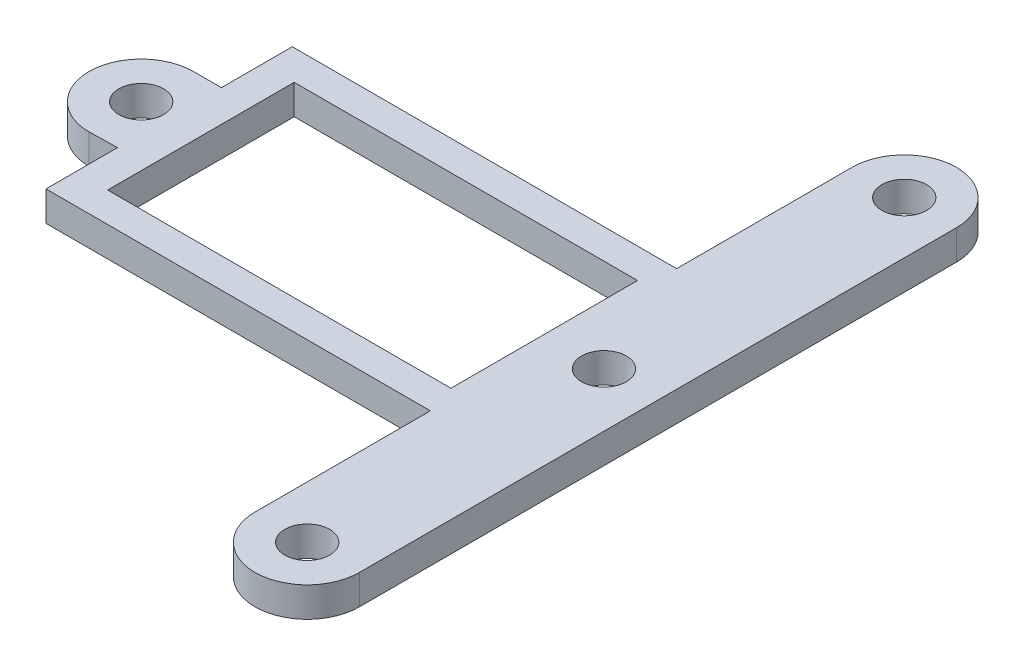
ISO-10303-21;
HEADER;
FILE_DESCRIPTION(('STEP AP214'),'2;1');
FILE_NAME('part.step','',(''),(''),'','','');
FILE_SCHEMA(('AUTOMOTIVE_DESIGN { 1 0 10303 214 1 1 1 1 }'));
ENDSEC;
DATA;
#1=APPLICATION_CONTEXT('core data for automotive mechanical design processes');
#2=APPLICATION_PROTOCOL_DEFINITION('international standard','automotive_design',2000,#1);
#3=PRODUCT_CONTEXT('',#1,'mechanical');
#4=PRODUCT('Part','Part','',(#3));
#5=PRODUCT_RELATED_PRODUCT_CATEGORY('part','',(#4));
#6=PRODUCT_DEFINITION_FORMATION('','',#4);
#7=PRODUCT_DEFINITION_CONTEXT('part definition',#1,'design');
#8=PRODUCT_DEFINITION('design','',#6,#7);
#9=PRODUCT_DEFINITION_SHAPE('','',#8);
#10=(LENGTH_UNIT() NAMED_UNIT(*) SI_UNIT(.MILLI.,.METRE.));
#11=(NAMED_UNIT(*) PLANE_ANGLE_UNIT() SI_UNIT($,.RADIAN.));
#12=(NAMED_UNIT(*) SI_UNIT($,.STERADIAN.) SOLID_ANGLE_UNIT());
#13=UNCERTAINTY_MEASURE_WITH_UNIT(LENGTH_MEASURE(1.E-05),#10,'distance_accuracy_value','');
#14=(GEOMETRIC_REPRESENTATION_CONTEXT(3) GLOBAL_UNCERTAINTY_ASSIGNED_CONTEXT((#13)) GLOBAL_UNIT_ASSIGNED_CONTEXT((#10,
#11,#12)) REPRESENTATION_CONTEXT('',''));
#15=CARTESIAN_POINT('',(0.,0.,0.));
#16=DIRECTION('',(0.,0.,1.));
#17=DIRECTION('',(1.,0.,0.));
#18=AXIS2_PLACEMENT_3D('',#15,#16,#17);
#19=CARTESIAN_POINT('',(0.,2.,8.25));
#20=DIRECTION('',(0.,0.,1.));
#21=DIRECTION('',(1.,0.,0.));
#22=AXIS2_PLACEMENT_3D('',#19,#20,#21);
#23=PLANE('',#22);
#24=DIRECTION('',(-1.,0.,0.));
#25=VECTOR('',#24,1.);
#26=CARTESIAN_POINT('',(0.,0.,8.25));
#27=LINE('',#26,#25);
#28=CARTESIAN_POINT('',(16.63,0.,8.25));
#29=VERTEX_POINT('',#28);
#30=CARTESIAN_POINT('',(-9.12,0.,8.25));
#31=VERTEX_POINT('',#30);
#32=EDGE_CURVE('E181',#29,#31,#27,.T.);
#33=ORIENTED_EDGE('',*,*,#32,.F.);
#34=DIRECTION('',(0.,-1.,0.));
#35=VECTOR('',#34,1.);
#36=CARTESIAN_POINT('',(16.63,2.,8.25));
#37=LINE('',#36,#35);
#38=CARTESIAN_POINT('',(16.63,2.,8.25));
#39=VERTEX_POINT('',#38);
#40=EDGE_CURVE('E11',#39,#29,#37,.T.);
#41=ORIENTED_EDGE('',*,*,#40,.F.);
#42=DIRECTION('',(-1.,0.,0.));
#43=VECTOR('',#42,1.);
#44=CARTESIAN_POINT('',(0.,2.,8.25));
#45=LINE('',#44,#43);
#46=CARTESIAN_POINT('',(-9.12,2.,8.25));
#47=VERTEX_POINT('',#46);
#48=EDGE_CURVE('E185',#39,#47,#45,.T.);
#49=ORIENTED_EDGE('',*,*,#48,.T.);
#50=DIRECTION('',(0.,-1.,0.));
#51=VECTOR('',#50,1.);
#52=CARTESIAN_POINT('',(-9.12,2.,8.25));
#53=LINE('',#52,#51);
#54=EDGE_CURVE('E229',#47,#31,#53,.T.);
#55=ORIENTED_EDGE('',*,*,#54,.T.);
#56=EDGE_LOOP('',(#33,#41,#49,#55));
#57=FACE_BOUND('',#56,.T.);
#58=ADVANCED_FACE('F37',(#57),#23,.T.);
#59=CARTESIAN_POINT('',(16.63,2.,0.));
#60=DIRECTION('',(1.,0.,0.));
#61=DIRECTION('',(0.,0.,-1.));
#62=AXIS2_PLACEMENT_3D('',#59,#60,#61);
#63=PLANE('',#62);
#64=DIRECTION('',(0.,0.,1.));
#65=VECTOR('',#64,1.);
#66=CARTESIAN_POINT('',(16.63,0.,0.));
#67=LINE('',#66,#65);
#68=CARTESIAN_POINT('',(16.63,0.,20.));
#69=VERTEX_POINT('',#68);
#70=EDGE_CURVE('E232',#29,#69,#67,.T.);
#71=ORIENTED_EDGE('',*,*,#70,.T.);
#72=DIRECTION('',(0.,-1.,0.));
#73=VECTOR('',#72,1.);
#74=CARTESIAN_POINT('',(16.63,2.,20.));
#75=LINE('',#74,#73);
#76=CARTESIAN_POINT('',(16.63,2.,20.));
#77=VERTEX_POINT('',#76);
#78=EDGE_CURVE('E44',#77,#69,#75,.T.);
#79=ORIENTED_EDGE('',*,*,#78,.F.);
#80=DIRECTION('',(0.,0.,1.));
#81=VECTOR('',#80,1.);
#82=CARTESIAN_POINT('',(16.63,2.,0.));
#83=LINE('',#82,#81);
#84=EDGE_CURVE('E188',#39,#77,#83,.T.);
#85=ORIENTED_EDGE('',*,*,#84,.F.);
#86=ORIENTED_EDGE('',*,*,#40,.T.);
#87=EDGE_LOOP('',(#71,#79,#85,#86));
#88=FACE_BOUND('',#87,.T.);
#89=ADVANCED_FACE('F302',(#88),#63,.F.);
#90=CARTESIAN_POINT('',(20.13,2.,20.));
#91=DIRECTION('',(0.,-1.,0.));
#92=DIRECTION('',(0.,0.,-1.));
#93=AXIS2_PLACEMENT_3D('',#90,#91,#92);
#94=CYLINDRICAL_SURFACE('',#93,3.5);
#95=CARTESIAN_POINT('',(20.13,0.,20.));
#96=DIRECTION('',(0.,1.,0.));
#97=DIRECTION('',(0.,0.,1.));
#98=AXIS2_PLACEMENT_3D('',#95,#96,#97);
#99=CIRCLE('',#98,3.5);
#100=CARTESIAN_POINT('',(23.63,0.,20.));
#101=VERTEX_POINT('',#100);
#102=EDGE_CURVE('E235',#101,#69,#99,.F.);
#103=ORIENTED_EDGE('',*,*,#102,.F.);
#104=DIRECTION('',(0.,-1.,0.));
#105=VECTOR('',#104,1.);
#106=CARTESIAN_POINT('',(23.63,2.,20.));
#107=LINE('',#106,#105);
#108=CARTESIAN_POINT('',(23.63,2.,20.));
#109=VERTEX_POINT('',#108);
#110=EDGE_CURVE('E293',#109,#101,#107,.T.);
#111=ORIENTED_EDGE('',*,*,#110,.F.);
#112=CARTESIAN_POINT('',(20.13,2.,20.));
#113=DIRECTION('',(0.,1.,0.));
#114=DIRECTION('',(0.,0.,1.));
#115=AXIS2_PLACEMENT_3D('',#112,#113,#114);
#116=CIRCLE('',#115,3.5);
#117=EDGE_CURVE('E191',#109,#77,#116,.F.);
#118=ORIENTED_EDGE('',*,*,#117,.T.);
#119=ORIENTED_EDGE('',*,*,#78,.T.);
#120=EDGE_LOOP('',(#103,#111,#118,#119));
#121=FACE_BOUND('',#120,.T.);
#122=ADVANCED_FACE('F297',(#121),#94,.T.);
#123=CARTESIAN_POINT('',(23.63,2.,0.));
#124=DIRECTION('',(1.,0.,0.));
#125=DIRECTION('',(0.,0.,-1.));
#126=AXIS2_PLACEMENT_3D('',#123,#124,#125);
#127=PLANE('',#126);
#128=DIRECTION('',(0.,0.,1.));
#129=VECTOR('',#128,1.);
#130=CARTESIAN_POINT('',(23.63,0.,0.));
#131=LINE('',#130,#129);
#132=CARTESIAN_POINT('',(23.63,0.,-20.));
#133=VERTEX_POINT('',#132);
#134=EDGE_CURVE('E238',#133,#101,#131,.T.);
#135=ORIENTED_EDGE('',*,*,#134,.F.);
#136=DIRECTION('',(0.,-1.,0.));
#137=VECTOR('',#136,1.);
#138=CARTESIAN_POINT('',(23.63,2.,-20.));
#139=LINE('',#138,#137);
#140=CARTESIAN_POINT('',(23.63,2.,-20.));
#141=VERTEX_POINT('',#140);
#142=EDGE_CURVE('E291',#141,#133,#139,.T.);
#143=ORIENTED_EDGE('',*,*,#142,.F.);
#144=DIRECTION('',(0.,0.,1.));
#145=VECTOR('',#144,1.);
#146=CARTESIAN_POINT('',(23.63,2.,0.));
#147=LINE('',#146,#145);
#148=EDGE_CURVE('E194',#141,#109,#147,.T.);
#149=ORIENTED_EDGE('',*,*,#148,.T.);
#150=ORIENTED_EDGE('',*,*,#110,.T.);
#151=EDGE_LOOP('',(#135,#143,#149,#150));
#152=FACE_BOUND('',#151,.T.);
#153=ADVANCED_FACE('F309',(#152),#127,.T.);
#154=CARTESIAN_POINT('',(20.13,2.,-20.));
#155=DIRECTION('',(0.,-1.,0.));
#156=DIRECTION('',(0.,0.,-1.));
#157=AXIS2_PLACEMENT_3D('',#154,#155,#156);
#158=CYLINDRICAL_SURFACE('',#157,3.5);
#159=CARTESIAN_POINT('',(20.13,0.,-20.));
#160=DIRECTION('',(0.,1.,0.));
#161=DIRECTION('',(0.,0.,1.));
#162=AXIS2_PLACEMENT_3D('',#159,#160,#161);
#163=CIRCLE('',#162,3.5);
#164=CARTESIAN_POINT('',(16.63,0.,-20.));
#165=VERTEX_POINT('',#164);
#166=EDGE_CURVE('E241',#133,#165,#163,.T.);
#167=ORIENTED_EDGE('',*,*,#166,.T.);
#168=DIRECTION('',(0.,-1.,0.));
#169=VECTOR('',#168,1.);
#170=CARTESIAN_POINT('',(16.63,2.,-20.));
#171=LINE('',#170,#169);
#172=CARTESIAN_POINT('',(16.63,2.,-20.));
#173=VERTEX_POINT('',#172);
#174=EDGE_CURVE('E288',#173,#165,#171,.T.);
#175=ORIENTED_EDGE('',*,*,#174,.F.);
#176=CARTESIAN_POINT('',(20.13,2.,-20.));
#177=DIRECTION('',(0.,1.,0.));
#178=DIRECTION('',(0.,0.,1.));
#179=AXIS2_PLACEMENT_3D('',#176,#177,#178);
#180=CIRCLE('',#179,3.5);
#181=EDGE_CURVE('E197',#141,#173,#180,.T.);
#182=ORIENTED_EDGE('',*,*,#181,.F.);
#183=ORIENTED_EDGE('',*,*,#142,.T.);
#184=EDGE_LOOP('',(#167,#175,#182,#183));
#185=FACE_BOUND('',#184,.T.);
#186=ADVANCED_FACE('F348',(#185),#158,.T.);
#187=CARTESIAN_POINT('',(16.63,2.,0.));
#188=DIRECTION('',(1.,0.,0.));
#189=DIRECTION('',(0.,0.,-1.));
#190=AXIS2_PLACEMENT_3D('',#187,#188,#189);
#191=PLANE('',#190);
#192=DIRECTION('',(0.,0.,1.));
#193=VECTOR('',#192,1.);
#194=CARTESIAN_POINT('',(16.63,0.,0.));
#195=LINE('',#194,#193);
#196=CARTESIAN_POINT('',(16.63,0.,-8.25));
#197=VERTEX_POINT('',#196);
#198=EDGE_CURVE('E243',#165,#197,#195,.T.);
#199=ORIENTED_EDGE('',*,*,#198,.T.);
#200=DIRECTION('',(0.,-1.,0.));
#201=VECTOR('',#200,1.);
#202=CARTESIAN_POINT('',(16.63,2.,-8.25));
#203=LINE('',#202,#201);
#204=CARTESIAN_POINT('',(16.63,2.,-8.25));
#205=VERTEX_POINT('',#204);
#206=EDGE_CURVE('E286',#205,#197,#203,.T.);
#207=ORIENTED_EDGE('',*,*,#206,.F.);
#208=DIRECTION('',(0.,0.,1.));
#209=VECTOR('',#208,1.);
#210=CARTESIAN_POINT('',(16.63,2.,0.));
#211=LINE('',#210,#209);
#212=EDGE_CURVE('E199',#173,#205,#211,.T.);
#213=ORIENTED_EDGE('',*,*,#212,.F.);
#214=ORIENTED_EDGE('',*,*,#174,.T.);
#215=EDGE_LOOP('',(#199,#207,#213,#214));
#216=FACE_BOUND('',#215,.T.);
#217=ADVANCED_FACE('F345',(#216),#191,.F.);
#218=CARTESIAN_POINT('',(0.,2.,-8.25));
#219=DIRECTION('',(0.,0.,-1.));
#220=DIRECTION('',(-1.,0.,0.));
#221=AXIS2_PLACEMENT_3D('',#218,#219,#220);
#222=PLANE('',#221);
#223=DIRECTION('',(1.,0.,0.));
#224=VECTOR('',#223,1.);
#225=CARTESIAN_POINT('',(0.,0.,-8.25));
#226=LINE('',#225,#224);
#227=CARTESIAN_POINT('',(-9.12,0.,-8.25));
#228=VERTEX_POINT('',#227);
#229=EDGE_CURVE('E246',#228,#197,#226,.T.);
#230=ORIENTED_EDGE('',*,*,#229,.F.);
#231=DIRECTION('',(0.,-1.,0.));
#232=VECTOR('',#231,1.);
#233=CARTESIAN_POINT('',(-9.12,2.,-8.25));
#234=LINE('',#233,#232);
#235=CARTESIAN_POINT('',(-9.12,2.,-8.25));
#236=VERTEX_POINT('',#235);
#237=EDGE_CURVE('E284',#236,#228,#234,.T.);
#238=ORIENTED_EDGE('',*,*,#237,.F.);
#239=DIRECTION('',(1.,0.,0.));
#240=VECTOR('',#239,1.);
#241=CARTESIAN_POINT('',(0.,2.,-8.25));
#242=LINE('',#241,#240);
#243=EDGE_CURVE('E201',#236,#205,#242,.T.);
#244=ORIENTED_EDGE('',*,*,#243,.T.);
#245=ORIENTED_EDGE('',*,*,#206,.T.);
#246=EDGE_LOOP('',(#230,#238,#244,#245));
#247=FACE_BOUND('',#246,.T.);
#248=ADVANCED_FACE('F340',(#247),#222,.T.);
#249=CARTESIAN_POINT('',(-9.12,2.,0.));
#250=DIRECTION('',(-1.,0.,0.));
#251=DIRECTION('',(0.,0.,1.));
#252=AXIS2_PLACEMENT_3D('',#249,#250,#251);
#253=PLANE('',#252);
#254=DIRECTION('',(0.,0.,-1.));
#255=VECTOR('',#254,1.);
#256=CARTESIAN_POINT('',(-9.12,0.,0.));
#257=LINE('',#256,#255);
#258=CARTESIAN_POINT('',(-9.12,0.,-3.49999999999999));
#259=VERTEX_POINT('',#258);
#260=EDGE_CURVE('E249',#259,#228,#257,.T.);
#261=ORIENTED_EDGE('',*,*,#260,.F.);
#262=DIRECTION('',(0.,-1.,0.));
#263=VECTOR('',#262,1.);
#264=CARTESIAN_POINT('',(-9.12,2.,-3.49999999999999));
#265=LINE('',#264,#263);
#266=CARTESIAN_POINT('',(-9.12,2.,-3.49999999999999));
#267=VERTEX_POINT('',#266);
#268=EDGE_CURVE('E282',#267,#259,#265,.T.);
#269=ORIENTED_EDGE('',*,*,#268,.F.);
#270=DIRECTION('',(0.,0.,-1.));
#271=VECTOR('',#270,1.);
#272=CARTESIAN_POINT('',(-9.12,2.,0.));
#273=LINE('',#272,#271);
#274=EDGE_CURVE('E204',#267,#236,#273,.T.);
#275=ORIENTED_EDGE('',*,*,#274,.T.);
#276=ORIENTED_EDGE('',*,*,#237,.T.);
#277=EDGE_LOOP('',(#261,#269,#275,#276));
#278=FACE_BOUND('',#277,.T.);
#279=ADVANCED_FACE('F337',(#278),#253,.T.);
#280=CARTESIAN_POINT('',(0.,2.,-3.49999999999999));
#281=DIRECTION('',(0.,0.,-1.));
#282=DIRECTION('',(-1.,0.,0.));
#283=AXIS2_PLACEMENT_3D('',#280,#281,#282);
#284=PLANE('',#283);
#285=DIRECTION('',(1.,0.,0.));
#286=VECTOR('',#285,1.);
#287=CARTESIAN_POINT('',(0.,0.,-3.49999999999999));
#288=LINE('',#287,#286);
#289=CARTESIAN_POINT('',(-10.99,0.,-3.49999999999999));
#290=VERTEX_POINT('',#289);
#291=EDGE_CURVE('E252',#290,#259,#288,.T.);
#292=ORIENTED_EDGE('',*,*,#291,.F.);
#293=DIRECTION('',(0.,-1.,0.));
#294=VECTOR('',#293,1.);
#295=CARTESIAN_POINT('',(-10.99,2.,-3.49999999999999));
#296=LINE('',#295,#294);
#297=CARTESIAN_POINT('',(-10.99,2.,-3.49999999999999));
#298=VERTEX_POINT('',#297);
#299=EDGE_CURVE('E280',#298,#290,#296,.T.);
#300=ORIENTED_EDGE('',*,*,#299,.F.);
#301=DIRECTION('',(1.,0.,0.));
#302=VECTOR('',#301,1.);
#303=CARTESIAN_POINT('',(0.,2.,-3.49999999999999));
#304=LINE('',#303,#302);
#305=EDGE_CURVE('E207',#298,#267,#304,.T.);
#306=ORIENTED_EDGE('',*,*,#305,.T.);
#307=ORIENTED_EDGE('',*,*,#268,.T.);
#308=EDGE_LOOP('',(#292,#300,#306,#307));
#309=FACE_BOUND('',#308,.T.);
#310=ADVANCED_FACE('F331',(#309),#284,.T.);
#311=CARTESIAN_POINT('',(-10.99,2.,0.));
#312=DIRECTION('',(0.,-1.,0.));
#313=DIRECTION('',(0.,0.,-1.));
#314=AXIS2_PLACEMENT_3D('',#311,#312,#313);
#315=CYLINDRICAL_SURFACE('',#314,3.5);
#316=CARTESIAN_POINT('',(-10.99,0.,0.));
#317=DIRECTION('',(0.,1.,0.));
#318=DIRECTION('',(0.,0.,1.));
#319=AXIS2_PLACEMENT_3D('',#316,#317,#318);
#320=CIRCLE('',#319,3.5);
#321=CARTESIAN_POINT('',(-10.99,0.,3.50000000000001));
#322=VERTEX_POINT('',#321);
#323=EDGE_CURVE('E255',#290,#322,#320,.T.);
#324=ORIENTED_EDGE('',*,*,#323,.T.);
#325=DIRECTION('',(0.,-1.,0.));
#326=VECTOR('',#325,1.);
#327=CARTESIAN_POINT('',(-10.99,2.,3.50000000000001));
#328=LINE('',#327,#326);
#329=CARTESIAN_POINT('',(-10.99,2.,3.50000000000001));
#330=VERTEX_POINT('',#329);
#331=EDGE_CURVE('E277',#330,#322,#328,.T.);
#332=ORIENTED_EDGE('',*,*,#331,.F.);
#333=CARTESIAN_POINT('',(-10.99,2.,0.));
#334=DIRECTION('',(0.,1.,0.));
#335=DIRECTION('',(0.,0.,1.));
#336=AXIS2_PLACEMENT_3D('',#333,#334,#335);
#337=CIRCLE('',#336,3.5);
#338=EDGE_CURVE('E210',#298,#330,#337,.T.);
#339=ORIENTED_EDGE('',*,*,#338,.F.);
#340=ORIENTED_EDGE('',*,*,#299,.T.);
#341=EDGE_LOOP('',(#324,#332,#339,#340));
#342=FACE_BOUND('',#341,.T.);
#343=ADVANCED_FACE('F349',(#342),#315,.T.);
#344=CARTESIAN_POINT('',(0.0734060516007423,2.,3.25012634284459));
#345=DIRECTION('',(-0.0225798410475209,0.,-0.99974504288757));
#346=DIRECTION('',(-0.99974504288757,0.,0.0225798410475209));
#347=AXIS2_PLACEMENT_3D('',#344,#345,#346);
#348=PLANE('',#347);
#349=DIRECTION('',(0.99974504288757,0.,-0.0225798410475209));
#350=VECTOR('',#349,1.);
#351=CARTESIAN_POINT('',(0.0734060516007423,0.,3.25012634284459));
#352=LINE('',#351,#350);
#353=CARTESIAN_POINT('',(-9.12,0.,3.45776492910943));
#354=VERTEX_POINT('',#353);
#355=EDGE_CURVE('E257',#322,#354,#352,.T.);
#356=ORIENTED_EDGE('',*,*,#355,.T.);
#357=DIRECTION('',(0.,-1.,0.));
#358=VECTOR('',#357,1.);
#359=CARTESIAN_POINT('',(-9.12,2.,3.45776492910943));
#360=LINE('',#359,#358);
#361=CARTESIAN_POINT('',(-9.12,2.,3.45776492910943));
#362=VERTEX_POINT('',#361);
#363=EDGE_CURVE('E275',#362,#354,#360,.T.);
#364=ORIENTED_EDGE('',*,*,#363,.F.);
#365=DIRECTION('',(0.99974504288757,0.,-0.0225798410475209));
#366=VECTOR('',#365,1.);
#367=CARTESIAN_POINT('',(0.0734060516007423,2.,3.25012634284459));
#368=LINE('',#367,#366);
#369=EDGE_CURVE('E212',#330,#362,#368,.T.);
#370=ORIENTED_EDGE('',*,*,#369,.F.);
#371=ORIENTED_EDGE('',*,*,#331,.T.);
#372=EDGE_LOOP('',(#356,#364,#370,#371));
#373=FACE_BOUND('',#372,.T.);
#374=ADVANCED_FACE('F325',(#373),#348,.F.);
#375=CARTESIAN_POINT('',(20.13,2.,-20.));
#376=DIRECTION('',(0.,-1.,0.));
#377=DIRECTION('',(0.,0.,-1.));
#378=AXIS2_PLACEMENT_3D('',#375,#376,#377);
#379=CYLINDRICAL_SURFACE('',#378,1.5);
#380=CARTESIAN_POINT('',(20.13,2.,-20.));
#381=DIRECTION('',(0.,1.,0.));
#382=DIRECTION('',(0.,0.,1.));
#383=AXIS2_PLACEMENT_3D('',#380,#381,#382);
#384=CIRCLE('',#383,1.5);
#385=CARTESIAN_POINT('',(20.13,2.,-18.5));
#386=VERTEX_POINT('',#385);
#387=EDGE_CURVE('E223',#386,#386,#384,.T.);
#388=ORIENTED_EDGE('',*,*,#387,.T.);
#389=EDGE_LOOP('',(#388));
#390=FACE_BOUND('',#389,.T.);
#391=CARTESIAN_POINT('',(20.13,0.,-20.));
#392=DIRECTION('',(0.,1.,0.));
#393=DIRECTION('',(0.,0.,1.));
#394=AXIS2_PLACEMENT_3D('',#391,#392,#393);
#395=CIRCLE('',#394,1.5);
#396=CARTESIAN_POINT('',(20.13,0.,-18.5));
#397=VERTEX_POINT('',#396);
#398=EDGE_CURVE('E269',#397,#397,#395,.T.);
#399=ORIENTED_EDGE('',*,*,#398,.F.);
#400=EDGE_LOOP('',(#399));
#401=FACE_BOUND('',#400,.T.);
#402=ADVANCED_FACE('F356',(#390,#401),#379,.F.);
#403=CARTESIAN_POINT('',(-10.99,2.,0.));
#404=DIRECTION('',(0.,-1.,0.));
#405=DIRECTION('',(0.,0.,-1.));
#406=AXIS2_PLACEMENT_3D('',#403,#404,#405);
#407=CYLINDRICAL_SURFACE('',#406,1.5);
#408=CARTESIAN_POINT('',(-10.99,2.,0.));
#409=DIRECTION('',(0.,1.,0.));
#410=DIRECTION('',(0.,0.,1.));
#411=AXIS2_PLACEMENT_3D('',#408,#409,#410);
#412=CIRCLE('',#411,1.5);
#413=CARTESIAN_POINT('',(-10.99,2.,1.50000000000001));
#414=VERTEX_POINT('',#413);
#415=EDGE_CURVE('E220',#414,#414,#412,.T.);
#416=ORIENTED_EDGE('',*,*,#415,.T.);
#417=EDGE_LOOP('',(#416));
#418=FACE_BOUND('',#417,.T.);
#419=CARTESIAN_POINT('',(-10.99,0.,0.));
#420=DIRECTION('',(0.,1.,0.));
#421=DIRECTION('',(0.,0.,1.));
#422=AXIS2_PLACEMENT_3D('',#419,#420,#421);
#423=CIRCLE('',#422,1.5);
#424=CARTESIAN_POINT('',(-10.99,0.,1.50000000000001));
#425=VERTEX_POINT('',#424);
#426=EDGE_CURVE('E266',#425,#425,#423,.T.);
#427=ORIENTED_EDGE('',*,*,#426,.F.);
#428=EDGE_LOOP('',(#427));
#429=FACE_BOUND('',#428,.T.);
#430=ADVANCED_FACE('F404',(#418,#429),#407,.F.);
#431=CARTESIAN_POINT('',(20.01,2.,0.));
#432=DIRECTION('',(0.,-1.,0.));
#433=DIRECTION('',(0.,0.,-1.));
#434=AXIS2_PLACEMENT_3D('',#431,#432,#433);
#435=CYLINDRICAL_SURFACE('',#434,1.5);
#436=CARTESIAN_POINT('',(20.01,2.,0.));
#437=DIRECTION('',(0.,1.,0.));
#438=DIRECTION('',(0.,0.,1.));
#439=AXIS2_PLACEMENT_3D('',#436,#437,#438);
#440=CIRCLE('',#439,1.5);
#441=CARTESIAN_POINT('',(20.01,2.,1.50000000000001));
#442=VERTEX_POINT('',#441);
#443=EDGE_CURVE('E217',#442,#442,#440,.T.);
#444=ORIENTED_EDGE('',*,*,#443,.T.);
#445=EDGE_LOOP('',(#444));
#446=FACE_BOUND('',#445,.T.);
#447=CARTESIAN_POINT('',(20.01,0.,0.));
#448=DIRECTION('',(0.,1.,0.));
#449=DIRECTION('',(0.,0.,1.));
#450=AXIS2_PLACEMENT_3D('',#447,#448,#449);
#451=CIRCLE('',#450,1.5);
#452=CARTESIAN_POINT('',(20.01,0.,1.50000000000001));
#453=VERTEX_POINT('',#452);
#454=EDGE_CURVE('E263',#453,#453,#451,.T.);
#455=ORIENTED_EDGE('',*,*,#454,.F.);
#456=EDGE_LOOP('',(#455));
#457=FACE_BOUND('',#456,.T.);
#458=ADVANCED_FACE('F414',(#446,#457),#435,.F.);
#459=CARTESIAN_POINT('',(-9.12,2.,0.));
#460=DIRECTION('',(-1.,0.,0.));
#461=DIRECTION('',(0.,0.,1.));
#462=AXIS2_PLACEMENT_3D('',#459,#460,#461);
#463=PLANE('',#462);
#464=DIRECTION('',(0.,0.,-1.));
#465=VECTOR('',#464,1.);
#466=CARTESIAN_POINT('',(-9.12,0.,0.));
#467=LINE('',#466,#465);
#468=EDGE_CURVE('E260',#31,#354,#467,.T.);
#469=ORIENTED_EDGE('',*,*,#468,.F.);
#470=ORIENTED_EDGE('',*,*,#54,.F.);
#471=DIRECTION('',(0.,0.,-1.));
#472=VECTOR('',#471,1.);
#473=CARTESIAN_POINT('',(-9.12,2.,0.));
#474=LINE('',#473,#472);
#475=EDGE_CURVE('E214',#47,#362,#474,.T.);
#476=ORIENTED_EDGE('',*,*,#475,.T.);
#477=ORIENTED_EDGE('',*,*,#363,.T.);
#478=EDGE_LOOP('',(#469,#470,#476,#477));
#479=FACE_BOUND('',#478,.T.);
#480=ADVANCED_FACE('F321',(#479),#463,.T.);
#481=CARTESIAN_POINT('',(20.13,2.,20.));
#482=DIRECTION('',(0.,-1.,0.));
#483=DIRECTION('',(0.,0.,-1.));
#484=AXIS2_PLACEMENT_3D('',#481,#482,#483);
#485=CYLINDRICAL_SURFACE('',#484,1.5);
#486=CARTESIAN_POINT('',(20.13,2.,20.));
#487=DIRECTION('',(0.,1.,0.));
#488=DIRECTION('',(0.,0.,1.));
#489=AXIS2_PLACEMENT_3D('',#486,#487,#488);
#490=CIRCLE('',#489,1.5);
#491=CARTESIAN_POINT('',(20.13,2.,21.5));
#492=VERTEX_POINT('',#491);
#493=EDGE_CURVE('E226',#492,#492,#490,.F.);
#494=ORIENTED_EDGE('',*,*,#493,.F.);
#495=EDGE_LOOP('',(#494));
#496=FACE_BOUND('',#495,.T.);
#497=CARTESIAN_POINT('',(20.13,0.,20.));
#498=DIRECTION('',(0.,1.,0.));
#499=DIRECTION('',(0.,0.,1.));
#500=AXIS2_PLACEMENT_3D('',#497,#498,#499);
#501=CIRCLE('',#500,1.5);
#502=CARTESIAN_POINT('',(20.13,0.,21.5));
#503=VERTEX_POINT('',#502);
#504=EDGE_CURVE('E189',#503,#503,#501,.F.);
#505=ORIENTED_EDGE('',*,*,#504,.T.);
#506=EDGE_LOOP('',(#505));
#507=FACE_BOUND('',#506,.T.);
#508=ADVANCED_FACE('F433',(#496,#507),#485,.F.);
#509=CARTESIAN_POINT('',(0.,2.,0.));
#510=DIRECTION('',(0.,1.,0.));
#511=DIRECTION('',(0.,0.,1.));
#512=AXIS2_PLACEMENT_3D('',#509,#510,#511);
#513=PLANE('',#512);
#514=DIRECTION('',(0.,0.,-1.));
#515=VECTOR('',#514,1.);
#516=CARTESIAN_POINT('',(16.01,2.,-6.25));
#517=LINE('',#516,#515);
#518=CARTESIAN_POINT('',(16.01,2.,6.25));
#519=VERTEX_POINT('',#518);
#520=CARTESIAN_POINT('',(16.01,2.,-6.25));
#521=VERTEX_POINT('',#520);
#522=EDGE_CURVE('E51',#519,#521,#517,.T.);
#523=ORIENTED_EDGE('',*,*,#522,.F.);
#524=DIRECTION('',(1.,0.,0.));
#525=VECTOR('',#524,1.);
#526=CARTESIAN_POINT('',(16.01,2.,6.25));
#527=LINE('',#526,#525);
#528=CARTESIAN_POINT('',(-6.99,2.,6.25));
#529=VERTEX_POINT('',#528);
#530=EDGE_CURVE('E166',#529,#519,#527,.T.);
#531=ORIENTED_EDGE('',*,*,#530,.F.);
#532=DIRECTION('',(0.,0.,1.));
#533=VECTOR('',#532,1.);
#534=CARTESIAN_POINT('',(-6.99,2.,-6.25));
#535=LINE('',#534,#533);
#536=CARTESIAN_POINT('',(-6.99,2.,-6.25));
#537=VERTEX_POINT('',#536);
#538=EDGE_CURVE('E169',#537,#529,#535,.T.);
#539=ORIENTED_EDGE('',*,*,#538,.F.);
#540=DIRECTION('',(-1.,0.,0.));
#541=VECTOR('',#540,1.);
#542=CARTESIAN_POINT('',(16.01,2.,-6.25));
#543=LINE('',#542,#541);
#544=EDGE_CURVE('E175',#521,#537,#543,.T.);
#545=ORIENTED_EDGE('',*,*,#544,.F.);
#546=EDGE_LOOP('',(#523,#531,#539,#545));
#547=FACE_BOUND('',#546,.T.);
#548=ORIENTED_EDGE('',*,*,#48,.F.);
#549=ORIENTED_EDGE('',*,*,#84,.T.);
#550=ORIENTED_EDGE('',*,*,#117,.F.);
#551=ORIENTED_EDGE('',*,*,#148,.F.);
#552=ORIENTED_EDGE('',*,*,#181,.T.);
#553=ORIENTED_EDGE('',*,*,#212,.T.);
#554=ORIENTED_EDGE('',*,*,#243,.F.);
#555=ORIENTED_EDGE('',*,*,#274,.F.);
#556=ORIENTED_EDGE('',*,*,#305,.F.);
#557=ORIENTED_EDGE('',*,*,#338,.T.);
#558=ORIENTED_EDGE('',*,*,#369,.T.);
#559=ORIENTED_EDGE('',*,*,#475,.F.);
#560=EDGE_LOOP('',(#548,#549,#550,#551,#552,#553,#554,#555,#556,#557,#558,#559));
#561=FACE_BOUND('',#560,.T.);
#562=ORIENTED_EDGE('',*,*,#443,.F.);
#563=EDGE_LOOP('',(#562));
#564=FACE_BOUND('',#563,.T.);
#565=ORIENTED_EDGE('',*,*,#415,.F.);
#566=EDGE_LOOP('',(#565));
#567=FACE_BOUND('',#566,.T.);
#568=ORIENTED_EDGE('',*,*,#387,.F.);
#569=EDGE_LOOP('',(#568));
#570=FACE_BOUND('',#569,.T.);
#571=ORIENTED_EDGE('',*,*,#493,.T.);
#572=EDGE_LOOP('',(#571));
#573=FACE_BOUND('',#572,.T.);
#574=ADVANCED_FACE('F314',(#547,#561,#564,#567,#570,#573),#513,.T.);
#575=CARTESIAN_POINT('',(0.,0.,0.));
#576=DIRECTION('',(0.,1.,0.));
#577=DIRECTION('',(0.,0.,1.));
#578=AXIS2_PLACEMENT_3D('',#575,#576,#577);
#579=PLANE('',#578);
#580=DIRECTION('',(1.,0.,0.));
#581=VECTOR('',#580,1.);
#582=CARTESIAN_POINT('',(16.01,0.,6.25));
#583=LINE('',#582,#581);
#584=CARTESIAN_POINT('',(-6.99,0.,6.25));
#585=VERTEX_POINT('',#584);
#586=CARTESIAN_POINT('',(16.01,0.,6.25));
#587=VERTEX_POINT('',#586);
#588=EDGE_CURVE('E156',#585,#587,#583,.T.);
#589=ORIENTED_EDGE('',*,*,#588,.T.);
#590=DIRECTION('',(0.,0.,-1.));
#591=VECTOR('',#590,1.);
#592=CARTESIAN_POINT('',(16.01,0.,-6.25));
#593=LINE('',#592,#591);
#594=CARTESIAN_POINT('',(16.01,0.,-6.25));
#595=VERTEX_POINT('',#594);
#596=EDGE_CURVE('E150',#587,#595,#593,.T.);
#597=ORIENTED_EDGE('',*,*,#596,.T.);
#598=DIRECTION('',(-1.,0.,0.));
#599=VECTOR('',#598,1.);
#600=CARTESIAN_POINT('',(16.01,0.,-6.25));
#601=LINE('',#600,#599);
#602=CARTESIAN_POINT('',(-6.99,0.,-6.25));
#603=VERTEX_POINT('',#602);
#604=EDGE_CURVE('E159',#595,#603,#601,.T.);
#605=ORIENTED_EDGE('',*,*,#604,.T.);
#606=DIRECTION('',(0.,0.,1.));
#607=VECTOR('',#606,1.);
#608=CARTESIAN_POINT('',(-6.99,0.,-6.25));
#609=LINE('',#608,#607);
#610=EDGE_CURVE('E59',#603,#585,#609,.T.);
#611=ORIENTED_EDGE('',*,*,#610,.T.);
#612=EDGE_LOOP('',(#589,#597,#605,#611));
#613=FACE_BOUND('',#612,.T.);
#614=ORIENTED_EDGE('',*,*,#32,.T.);
#615=ORIENTED_EDGE('',*,*,#468,.T.);
#616=ORIENTED_EDGE('',*,*,#355,.F.);
#617=ORIENTED_EDGE('',*,*,#323,.F.);
#618=ORIENTED_EDGE('',*,*,#291,.T.);
#619=ORIENTED_EDGE('',*,*,#260,.T.);
#620=ORIENTED_EDGE('',*,*,#229,.T.);
#621=ORIENTED_EDGE('',*,*,#198,.F.);
#622=ORIENTED_EDGE('',*,*,#166,.F.);
#623=ORIENTED_EDGE('',*,*,#134,.T.);
#624=ORIENTED_EDGE('',*,*,#102,.T.);
#625=ORIENTED_EDGE('',*,*,#70,.F.);
#626=EDGE_LOOP('',(#614,#615,#616,#617,#618,#619,#620,#621,#622,#623,#624,#625));
#627=FACE_BOUND('',#626,.T.);
#628=ORIENTED_EDGE('',*,*,#454,.T.);
#629=EDGE_LOOP('',(#628));
#630=FACE_BOUND('',#629,.T.);
#631=ORIENTED_EDGE('',*,*,#426,.T.);
#632=EDGE_LOOP('',(#631));
#633=FACE_BOUND('',#632,.T.);
#634=ORIENTED_EDGE('',*,*,#398,.T.);
#635=EDGE_LOOP('',(#634));
#636=FACE_BOUND('',#635,.T.);
#637=ORIENTED_EDGE('',*,*,#504,.F.);
#638=EDGE_LOOP('',(#637));
#639=FACE_BOUND('',#638,.T.);
#640=ADVANCED_FACE('F163',(#613,#627,#630,#633,#636,#639),#579,.F.);
#641=CARTESIAN_POINT('',(16.01,0.,-6.25));
#642=DIRECTION('',(1.,0.,0.));
#643=DIRECTION('',(0.,0.,-1.));
#644=AXIS2_PLACEMENT_3D('',#641,#642,#643);
#645=PLANE('',#644);
#646=ORIENTED_EDGE('',*,*,#522,.T.);
#647=DIRECTION('',(0.,1.,0.));
#648=VECTOR('',#647,1.);
#649=CARTESIAN_POINT('',(16.01,0.,-6.25));
#650=LINE('',#649,#648);
#651=EDGE_CURVE('E146',#595,#521,#650,.T.);
#652=ORIENTED_EDGE('',*,*,#651,.F.);
#653=ORIENTED_EDGE('',*,*,#596,.F.);
#654=DIRECTION('',(0.,1.,0.));
#655=VECTOR('',#654,1.);
#656=CARTESIAN_POINT('',(16.01,0.,6.25));
#657=LINE('',#656,#655);
#658=EDGE_CURVE('E179',#587,#519,#657,.T.);
#659=ORIENTED_EDGE('',*,*,#658,.T.);
#660=EDGE_LOOP('',(#646,#652,#653,#659));
#661=FACE_BOUND('',#660,.T.);
#662=ADVANCED_FACE('F148',(#661),#645,.F.);
#663=CARTESIAN_POINT('',(16.01,0.,6.25));
#664=DIRECTION('',(0.,0.,1.));
#665=DIRECTION('',(1.,0.,0.));
#666=AXIS2_PLACEMENT_3D('',#663,#664,#665);
#667=PLANE('',#666);
#668=ORIENTED_EDGE('',*,*,#530,.T.);
#669=ORIENTED_EDGE('',*,*,#658,.F.);
#670=ORIENTED_EDGE('',*,*,#588,.F.);
#671=DIRECTION('',(0.,1.,0.));
#672=VECTOR('',#671,1.);
#673=CARTESIAN_POINT('',(-6.99,0.,6.25));
#674=LINE('',#673,#672);
#675=EDGE_CURVE('E182',#585,#529,#674,.T.);
#676=ORIENTED_EDGE('',*,*,#675,.T.);
#677=EDGE_LOOP('',(#668,#669,#670,#676));
#678=FACE_BOUND('',#677,.T.);
#679=ADVANCED_FACE('F472',(#678),#667,.F.);
#680=CARTESIAN_POINT('',(-6.99,0.,-6.25));
#681=DIRECTION('',(-1.,0.,0.));
#682=DIRECTION('',(0.,0.,1.));
#683=AXIS2_PLACEMENT_3D('',#680,#681,#682);
#684=PLANE('',#683);
#685=ORIENTED_EDGE('',*,*,#538,.T.);
#686=ORIENTED_EDGE('',*,*,#675,.F.);
#687=ORIENTED_EDGE('',*,*,#610,.F.);
#688=DIRECTION('',(0.,1.,0.));
#689=VECTOR('',#688,1.);
#690=CARTESIAN_POINT('',(-6.99,0.,-6.25));
#691=LINE('',#690,#689);
#692=EDGE_CURVE('E155',#603,#537,#691,.T.);
#693=ORIENTED_EDGE('',*,*,#692,.T.);
#694=EDGE_LOOP('',(#685,#686,#687,#693));
#695=FACE_BOUND('',#694,.T.);
#696=ADVANCED_FACE('F481',(#695),#684,.F.);
#697=CARTESIAN_POINT('',(16.01,0.,-6.25));
#698=DIRECTION('',(0.,0.,-1.));
#699=DIRECTION('',(-1.,0.,0.));
#700=AXIS2_PLACEMENT_3D('',#697,#698,#699);
#701=PLANE('',#700);
#702=ORIENTED_EDGE('',*,*,#544,.T.);
#703=ORIENTED_EDGE('',*,*,#692,.F.);
#704=ORIENTED_EDGE('',*,*,#604,.F.);
#705=ORIENTED_EDGE('',*,*,#651,.T.);
#706=EDGE_LOOP('',(#702,#703,#704,#705));
#707=FACE_BOUND('',#706,.T.);
#708=ADVANCED_FACE('F160',(#707),#701,.F.);
#709=CLOSED_SHELL('',(#58,#89,#122,#153,#186,#217,#248,#279,#310,#343,#374,#402,#430,#458,#480,
#508,#574,#640,#662,#679,#696,#708));
#710=MANIFOLD_SOLID_BREP('B2',#709);
#711=ADVANCED_BREP_SHAPE_REPRESENTATION('',(#18,#710),#14);
#712=SHAPE_DEFINITION_REPRESENTATION(#9,#711);
ENDSEC;
END-ISO-10303-21;
